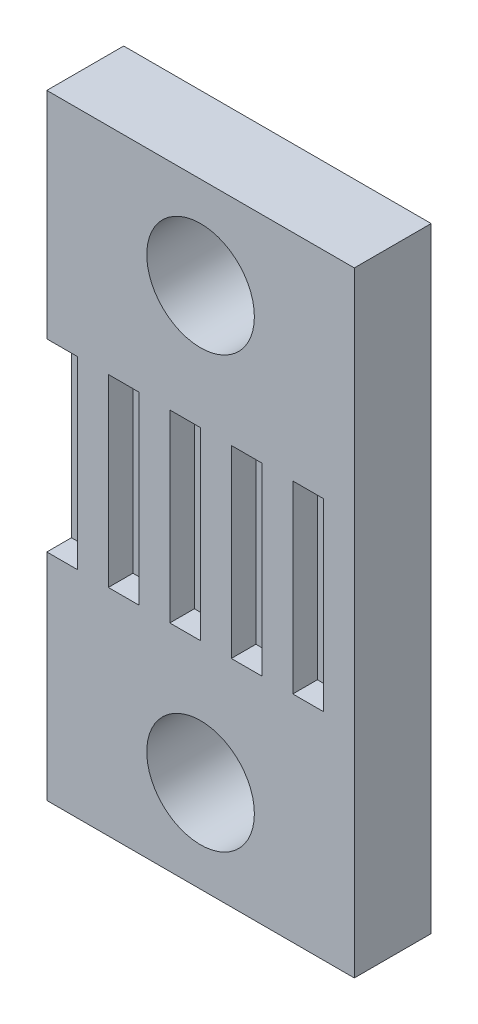
ISO-10303-21;
HEADER;
FILE_DESCRIPTION(('STEP AP214'),'2;1');
FILE_NAME('part.step','',(''),(''),'','','');
FILE_SCHEMA(('AUTOMOTIVE_DESIGN { 1 0 10303 214 1 1 1 1 }'));
ENDSEC;
DATA;
#1=APPLICATION_CONTEXT('core data for automotive mechanical design processes');
#2=APPLICATION_PROTOCOL_DEFINITION('international standard','automotive_design',2000,#1);
#3=PRODUCT_CONTEXT('',#1,'mechanical');
#4=PRODUCT('Part','Part','',(#3));
#5=PRODUCT_RELATED_PRODUCT_CATEGORY('part','',(#4));
#6=PRODUCT_DEFINITION_FORMATION('','',#4);
#7=PRODUCT_DEFINITION_CONTEXT('part definition',#1,'design');
#8=PRODUCT_DEFINITION('design','',#6,#7);
#9=PRODUCT_DEFINITION_SHAPE('','',#8);
#10=(LENGTH_UNIT() NAMED_UNIT(*) SI_UNIT(.MILLI.,.METRE.));
#11=(NAMED_UNIT(*) PLANE_ANGLE_UNIT() SI_UNIT($,.RADIAN.));
#12=(NAMED_UNIT(*) SI_UNIT($,.STERADIAN.) SOLID_ANGLE_UNIT());
#13=UNCERTAINTY_MEASURE_WITH_UNIT(LENGTH_MEASURE(1.E-05),#10,'distance_accuracy_value','');
#14=(GEOMETRIC_REPRESENTATION_CONTEXT(3) GLOBAL_UNCERTAINTY_ASSIGNED_CONTEXT((#13)) GLOBAL_UNIT_ASSIGNED_CONTEXT((#10,
#11,#12)) REPRESENTATION_CONTEXT('',''));
#15=CARTESIAN_POINT('',(0.,0.,0.));
#16=DIRECTION('',(0.,0.,1.));
#17=DIRECTION('',(1.,0.,0.));
#18=AXIS2_PLACEMENT_3D('',#15,#16,#17);
#19=CARTESIAN_POINT('',(0.,0.,2.5));
#20=DIRECTION('',(0.,0.,-1.));
#21=DIRECTION('',(-1.,0.,0.));
#22=AXIS2_PLACEMENT_3D('',#19,#20,#21);
#23=PLANE('',#22);
#24=DIRECTION('',(1.,0.,0.));
#25=VECTOR('',#24,1.);
#26=CARTESIAN_POINT('',(2.,7.,2.5));
#27=LINE('',#26,#25);
#28=CARTESIAN_POINT('',(2.,7.,2.5));
#29=VERTEX_POINT('',#28);
#30=CARTESIAN_POINT('',(3.,7.,2.5));
#31=VERTEX_POINT('',#30);
#32=EDGE_CURVE('E227',#29,#31,#27,.T.);
#33=ORIENTED_EDGE('',*,*,#32,.F.);
#34=DIRECTION('',(0.,-1.,0.));
#35=VECTOR('',#34,1.);
#36=CARTESIAN_POINT('',(2.,13.,2.5));
#37=LINE('',#36,#35);
#38=CARTESIAN_POINT('',(2.,13.,2.5));
#39=VERTEX_POINT('',#38);
#40=EDGE_CURVE('E52',#39,#29,#37,.T.);
#41=ORIENTED_EDGE('',*,*,#40,.F.);
#42=DIRECTION('',(-1.,0.,0.));
#43=VECTOR('',#42,1.);
#44=CARTESIAN_POINT('',(2.,13.,2.5));
#45=LINE('',#44,#43);
#46=CARTESIAN_POINT('',(3.,13.,2.5));
#47=VERTEX_POINT('',#46);
#48=EDGE_CURVE('E218',#47,#39,#45,.T.);
#49=ORIENTED_EDGE('',*,*,#48,.F.);
#50=DIRECTION('',(0.,1.,0.));
#51=VECTOR('',#50,1.);
#52=CARTESIAN_POINT('',(3.,13.,2.5));
#53=LINE('',#52,#51);
#54=EDGE_CURVE('E221',#31,#47,#53,.T.);
#55=ORIENTED_EDGE('',*,*,#54,.F.);
#56=EDGE_LOOP('',(#33,#41,#49,#55));
#57=FACE_BOUND('',#56,.T.);
#58=DIRECTION('',(1.,0.,0.));
#59=VECTOR('',#58,1.);
#60=CARTESIAN_POINT('',(4.,7.,2.5));
#61=LINE('',#60,#59);
#62=CARTESIAN_POINT('',(4.,7.,2.5));
#63=VERTEX_POINT('',#62);
#64=CARTESIAN_POINT('',(5.,7.,2.5));
#65=VERTEX_POINT('',#64);
#66=EDGE_CURVE('E253',#63,#65,#61,.T.);
#67=ORIENTED_EDGE('',*,*,#66,.F.);
#68=DIRECTION('',(0.,-1.,0.));
#69=VECTOR('',#68,1.);
#70=CARTESIAN_POINT('',(4.,13.,2.5));
#71=LINE('',#70,#69);
#72=CARTESIAN_POINT('',(4.,13.,2.5));
#73=VERTEX_POINT('',#72);
#74=EDGE_CURVE('E60',#73,#63,#71,.T.);
#75=ORIENTED_EDGE('',*,*,#74,.F.);
#76=DIRECTION('',(-1.,0.,0.));
#77=VECTOR('',#76,1.);
#78=CARTESIAN_POINT('',(4.,13.,2.5));
#79=LINE('',#78,#77);
#80=CARTESIAN_POINT('',(5.,13.,2.5));
#81=VERTEX_POINT('',#80);
#82=EDGE_CURVE('E242',#81,#73,#79,.T.);
#83=ORIENTED_EDGE('',*,*,#82,.F.);
#84=DIRECTION('',(0.,1.,0.));
#85=VECTOR('',#84,1.);
#86=CARTESIAN_POINT('',(5.,13.,2.5));
#87=LINE('',#86,#85);
#88=EDGE_CURVE('E257',#65,#81,#87,.T.);
#89=ORIENTED_EDGE('',*,*,#88,.F.);
#90=EDGE_LOOP('',(#67,#75,#83,#89));
#91=FACE_BOUND('',#90,.T.);
#92=DIRECTION('',(1.,0.,0.));
#93=VECTOR('',#92,1.);
#94=CARTESIAN_POINT('',(6.,7.,2.5));
#95=LINE('',#94,#93);
#96=CARTESIAN_POINT('',(6.,7.,2.5));
#97=VERTEX_POINT('',#96);
#98=CARTESIAN_POINT('',(7.,7.,2.5));
#99=VERTEX_POINT('',#98);
#100=EDGE_CURVE('E284',#97,#99,#95,.T.);
#101=ORIENTED_EDGE('',*,*,#100,.F.);
#102=DIRECTION('',(0.,-1.,0.));
#103=VECTOR('',#102,1.);
#104=CARTESIAN_POINT('',(6.,13.,2.5));
#105=LINE('',#104,#103);
#106=CARTESIAN_POINT('',(6.,13.,2.5));
#107=VERTEX_POINT('',#106);
#108=EDGE_CURVE('E282',#107,#97,#105,.T.);
#109=ORIENTED_EDGE('',*,*,#108,.F.);
#110=DIRECTION('',(-1.,0.,0.));
#111=VECTOR('',#110,1.);
#112=CARTESIAN_POINT('',(6.,13.,2.5));
#113=LINE('',#112,#111);
#114=CARTESIAN_POINT('',(7.,13.,2.5));
#115=VERTEX_POINT('',#114);
#116=EDGE_CURVE('E272',#115,#107,#113,.T.);
#117=ORIENTED_EDGE('',*,*,#116,.F.);
#118=DIRECTION('',(0.,1.,0.));
#119=VECTOR('',#118,1.);
#120=CARTESIAN_POINT('',(7.,13.,2.5));
#121=LINE('',#120,#119);
#122=EDGE_CURVE('E288',#99,#115,#121,.T.);
#123=ORIENTED_EDGE('',*,*,#122,.F.);
#124=EDGE_LOOP('',(#101,#109,#117,#123));
#125=FACE_BOUND('',#124,.T.);
#126=DIRECTION('',(1.,0.,0.));
#127=VECTOR('',#126,1.);
#128=CARTESIAN_POINT('',(8.,7.,2.5));
#129=LINE('',#128,#127);
#130=CARTESIAN_POINT('',(8.,7.,2.5));
#131=VERTEX_POINT('',#130);
#132=CARTESIAN_POINT('',(9.,7.,2.5));
#133=VERTEX_POINT('',#132);
#134=EDGE_CURVE('E316',#131,#133,#129,.T.);
#135=ORIENTED_EDGE('',*,*,#134,.F.);
#136=DIRECTION('',(0.,-1.,0.));
#137=VECTOR('',#136,1.);
#138=CARTESIAN_POINT('',(8.,13.,2.5));
#139=LINE('',#138,#137);
#140=CARTESIAN_POINT('',(8.,13.,2.5));
#141=VERTEX_POINT('',#140);
#142=EDGE_CURVE('E314',#141,#131,#139,.T.);
#143=ORIENTED_EDGE('',*,*,#142,.F.);
#144=DIRECTION('',(-1.,0.,0.));
#145=VECTOR('',#144,1.);
#146=CARTESIAN_POINT('',(8.,13.,2.5));
#147=LINE('',#146,#145);
#148=CARTESIAN_POINT('',(9.,13.,2.5));
#149=VERTEX_POINT('',#148);
#150=EDGE_CURVE('E304',#149,#141,#147,.T.);
#151=ORIENTED_EDGE('',*,*,#150,.F.);
#152=DIRECTION('',(0.,1.,0.));
#153=VECTOR('',#152,1.);
#154=CARTESIAN_POINT('',(9.,13.,2.5));
#155=LINE('',#154,#153);
#156=EDGE_CURVE('E319',#133,#149,#155,.T.);
#157=ORIENTED_EDGE('',*,*,#156,.F.);
#158=EDGE_LOOP('',(#135,#143,#151,#157));
#159=FACE_BOUND('',#158,.T.);
#160=DIRECTION('',(0.,-1.,0.));
#161=VECTOR('',#160,1.);
#162=CARTESIAN_POINT('',(0.,0.,2.5));
#163=LINE('',#162,#161);
#164=CARTESIAN_POINT('',(0.,20.,2.5));
#165=VERTEX_POINT('',#164);
#166=CARTESIAN_POINT('',(0.,13.,2.5));
#167=VERTEX_POINT('',#166);
#168=EDGE_CURVE('E371',#165,#167,#163,.T.);
#169=ORIENTED_EDGE('',*,*,#168,.T.);
#170=DIRECTION('',(-1.,0.,0.));
#171=VECTOR('',#170,1.);
#172=CARTESIAN_POINT('',(0.,13.,2.5));
#173=LINE('',#172,#171);
#174=CARTESIAN_POINT('',(0.999999999999995,13.,2.5));
#175=VERTEX_POINT('',#174);
#176=EDGE_CURVE('E335',#175,#167,#173,.T.);
#177=ORIENTED_EDGE('',*,*,#176,.F.);
#178=DIRECTION('',(0.,1.,0.));
#179=VECTOR('',#178,1.);
#180=CARTESIAN_POINT('',(0.999999999999995,13.,2.5));
#181=LINE('',#180,#179);
#182=CARTESIAN_POINT('',(0.999999999999995,7.,2.5));
#183=VERTEX_POINT('',#182);
#184=EDGE_CURVE('E346',#183,#175,#181,.T.);
#185=ORIENTED_EDGE('',*,*,#184,.F.);
#186=DIRECTION('',(1.,0.,0.));
#187=VECTOR('',#186,1.);
#188=CARTESIAN_POINT('',(0.,7.,2.5));
#189=LINE('',#188,#187);
#190=CARTESIAN_POINT('',(0.,7.,2.5));
#191=VERTEX_POINT('',#190);
#192=EDGE_CURVE('E234',#191,#183,#189,.T.);
#193=ORIENTED_EDGE('',*,*,#192,.F.);
#194=CARTESIAN_POINT('',(0.,0.,2.5));
#195=VERTEX_POINT('',#194);
#196=EDGE_CURVE('E375',#191,#195,#163,.T.);
#197=ORIENTED_EDGE('',*,*,#196,.T.);
#198=DIRECTION('',(1.,0.,0.));
#199=VECTOR('',#198,1.);
#200=CARTESIAN_POINT('',(0.,0.,2.5));
#201=LINE('',#200,#199);
#202=CARTESIAN_POINT('',(10.,0.,2.5));
#203=VERTEX_POINT('',#202);
#204=EDGE_CURVE('E374',#195,#203,#201,.T.);
#205=ORIENTED_EDGE('',*,*,#204,.T.);
#206=DIRECTION('',(0.,1.,0.));
#207=VECTOR('',#206,1.);
#208=CARTESIAN_POINT('',(10.,0.,2.5));
#209=LINE('',#208,#207);
#210=CARTESIAN_POINT('',(10.,20.,2.5));
#211=VERTEX_POINT('',#210);
#212=EDGE_CURVE('E377',#203,#211,#209,.T.);
#213=ORIENTED_EDGE('',*,*,#212,.T.);
#214=DIRECTION('',(-1.,0.,0.));
#215=VECTOR('',#214,1.);
#216=CARTESIAN_POINT('',(0.,20.,2.5));
#217=LINE('',#216,#215);
#218=EDGE_CURVE('E379',#211,#165,#217,.T.);
#219=ORIENTED_EDGE('',*,*,#218,.T.);
#220=EDGE_LOOP('',(#169,#177,#185,#193,#197,#205,#213,#219));
#221=FACE_BOUND('',#220,.T.);
#222=CARTESIAN_POINT('',(5.,17.,2.5));
#223=DIRECTION('',(0.,0.,1.));
#224=DIRECTION('',(1.,0.,0.));
#225=AXIS2_PLACEMENT_3D('',#222,#223,#224);
#226=CIRCLE('',#225,1.75);
#227=CARTESIAN_POINT('',(6.75,17.,2.5));
#228=VERTEX_POINT('',#227);
#229=EDGE_CURVE('E365',#228,#228,#226,.T.);
#230=ORIENTED_EDGE('',*,*,#229,.F.);
#231=EDGE_LOOP('',(#230));
#232=FACE_BOUND('',#231,.T.);
#233=CARTESIAN_POINT('',(5.,3.,2.5));
#234=DIRECTION('',(0.,0.,1.));
#235=DIRECTION('',(1.,0.,0.));
#236=AXIS2_PLACEMENT_3D('',#233,#234,#235);
#237=CIRCLE('',#236,1.75);
#238=CARTESIAN_POINT('',(6.75,3.,2.5));
#239=VERTEX_POINT('',#238);
#240=EDGE_CURVE('E359',#239,#239,#237,.T.);
#241=ORIENTED_EDGE('',*,*,#240,.F.);
#242=EDGE_LOOP('',(#241));
#243=FACE_BOUND('',#242,.T.);
#244=ADVANCED_FACE('F37',(#57,#91,#125,#159,#221,#232,#243),#23,.F.);
#245=CARTESIAN_POINT('',(0.,0.,0.));
#246=DIRECTION('',(0.,0.,-1.));
#247=DIRECTION('',(-1.,0.,0.));
#248=AXIS2_PLACEMENT_3D('',#245,#246,#247);
#249=PLANE('',#248);
#250=CARTESIAN_POINT('',(5.,17.,0.));
#251=DIRECTION('',(0.,0.,1.));
#252=DIRECTION('',(1.,0.,0.));
#253=AXIS2_PLACEMENT_3D('',#250,#251,#252);
#254=CIRCLE('',#253,1.75);
#255=CARTESIAN_POINT('',(6.75,17.,0.));
#256=VERTEX_POINT('',#255);
#257=EDGE_CURVE('E362',#256,#256,#254,.T.);
#258=ORIENTED_EDGE('',*,*,#257,.T.);
#259=EDGE_LOOP('',(#258));
#260=FACE_BOUND('',#259,.T.);
#261=DIRECTION('',(0.,-1.,0.));
#262=VECTOR('',#261,1.);
#263=CARTESIAN_POINT('',(0.,0.,0.));
#264=LINE('',#263,#262);
#265=CARTESIAN_POINT('',(0.,20.,0.));
#266=VERTEX_POINT('',#265);
#267=CARTESIAN_POINT('',(0.,0.,0.));
#268=VERTEX_POINT('',#267);
#269=EDGE_CURVE('E368',#266,#268,#264,.T.);
#270=ORIENTED_EDGE('',*,*,#269,.F.);
#271=DIRECTION('',(-1.,0.,0.));
#272=VECTOR('',#271,1.);
#273=CARTESIAN_POINT('',(0.,20.,0.));
#274=LINE('',#273,#272);
#275=CARTESIAN_POINT('',(10.,20.,0.));
#276=VERTEX_POINT('',#275);
#277=EDGE_CURVE('E388',#276,#266,#274,.T.);
#278=ORIENTED_EDGE('',*,*,#277,.F.);
#279=DIRECTION('',(0.,1.,0.));
#280=VECTOR('',#279,1.);
#281=CARTESIAN_POINT('',(10.,0.,0.));
#282=LINE('',#281,#280);
#283=CARTESIAN_POINT('',(10.,0.,0.));
#284=VERTEX_POINT('',#283);
#285=EDGE_CURVE('E386',#284,#276,#282,.T.);
#286=ORIENTED_EDGE('',*,*,#285,.F.);
#287=DIRECTION('',(1.,0.,0.));
#288=VECTOR('',#287,1.);
#289=CARTESIAN_POINT('',(0.,0.,0.));
#290=LINE('',#289,#288);
#291=EDGE_CURVE('E384',#268,#284,#290,.T.);
#292=ORIENTED_EDGE('',*,*,#291,.F.);
#293=EDGE_LOOP('',(#270,#278,#286,#292));
#294=FACE_BOUND('',#293,.T.);
#295=CARTESIAN_POINT('',(5.,3.,0.));
#296=DIRECTION('',(0.,0.,1.));
#297=DIRECTION('',(1.,0.,0.));
#298=AXIS2_PLACEMENT_3D('',#295,#296,#297);
#299=CIRCLE('',#298,1.75);
#300=CARTESIAN_POINT('',(6.75,3.,0.));
#301=VERTEX_POINT('',#300);
#302=EDGE_CURVE('E353',#301,#301,#299,.T.);
#303=ORIENTED_EDGE('',*,*,#302,.T.);
#304=EDGE_LOOP('',(#303));
#305=FACE_BOUND('',#304,.T.);
#306=ADVANCED_FACE('F406',(#260,#294,#305),#249,.T.);
#307=CARTESIAN_POINT('',(0.,0.,2.5));
#308=DIRECTION('',(1.,0.,0.));
#309=DIRECTION('',(0.,1.,0.));
#310=AXIS2_PLACEMENT_3D('',#307,#308,#309);
#311=PLANE('',#310);
#312=DIRECTION('',(0.,-1.,0.));
#313=VECTOR('',#312,1.);
#314=CARTESIAN_POINT('',(0.,13.,1.7));
#315=LINE('',#314,#313);
#316=CARTESIAN_POINT('',(0.,13.,1.7));
#317=VERTEX_POINT('',#316);
#318=CARTESIAN_POINT('',(0.,7.,1.7));
#319=VERTEX_POINT('',#318);
#320=EDGE_CURVE('E331',#317,#319,#315,.T.);
#321=ORIENTED_EDGE('',*,*,#320,.F.);
#322=DIRECTION('',(0.,0.,1.));
#323=VECTOR('',#322,1.);
#324=CARTESIAN_POINT('',(0.,13.,1.7));
#325=LINE('',#324,#323);
#326=EDGE_CURVE('E350',#317,#167,#325,.T.);
#327=ORIENTED_EDGE('',*,*,#326,.T.);
#328=ORIENTED_EDGE('',*,*,#168,.F.);
#329=DIRECTION('',(0.,0.,-1.));
#330=VECTOR('',#329,1.);
#331=CARTESIAN_POINT('',(0.,20.,2.5));
#332=LINE('',#331,#330);
#333=EDGE_CURVE('E381',#165,#266,#332,.T.);
#334=ORIENTED_EDGE('',*,*,#333,.T.);
#335=ORIENTED_EDGE('',*,*,#269,.T.);
#336=DIRECTION('',(0.,0.,-1.));
#337=VECTOR('',#336,1.);
#338=CARTESIAN_POINT('',(0.,0.,2.5));
#339=LINE('',#338,#337);
#340=EDGE_CURVE('E11',#195,#268,#339,.T.);
#341=ORIENTED_EDGE('',*,*,#340,.F.);
#342=ORIENTED_EDGE('',*,*,#196,.F.);
#343=DIRECTION('',(0.,0.,1.));
#344=VECTOR('',#343,1.);
#345=CARTESIAN_POINT('',(0.,7.,1.7));
#346=LINE('',#345,#344);
#347=EDGE_CURVE('E343',#319,#191,#346,.T.);
#348=ORIENTED_EDGE('',*,*,#347,.F.);
#349=EDGE_LOOP('',(#321,#327,#328,#334,#335,#341,#342,#348));
#350=FACE_BOUND('',#349,.T.);
#351=ADVANCED_FACE('F39',(#350),#311,.F.);
#352=CARTESIAN_POINT('',(0.,0.,2.5));
#353=DIRECTION('',(0.,1.,0.));
#354=DIRECTION('',(0.,0.,1.));
#355=AXIS2_PLACEMENT_3D('',#352,#353,#354);
#356=PLANE('',#355);
#357=ORIENTED_EDGE('',*,*,#291,.T.);
#358=DIRECTION('',(0.,0.,-1.));
#359=VECTOR('',#358,1.);
#360=CARTESIAN_POINT('',(10.,0.,2.5));
#361=LINE('',#360,#359);
#362=EDGE_CURVE('E45',#203,#284,#361,.T.);
#363=ORIENTED_EDGE('',*,*,#362,.F.);
#364=ORIENTED_EDGE('',*,*,#204,.F.);
#365=ORIENTED_EDGE('',*,*,#340,.T.);
#366=EDGE_LOOP('',(#357,#363,#364,#365));
#367=FACE_BOUND('',#366,.T.);
#368=ADVANCED_FACE('F423',(#367),#356,.F.);
#369=CARTESIAN_POINT('',(10.,0.,2.5));
#370=DIRECTION('',(-1.,0.,0.));
#371=DIRECTION('',(0.,0.,1.));
#372=AXIS2_PLACEMENT_3D('',#369,#370,#371);
#373=PLANE('',#372);
#374=ORIENTED_EDGE('',*,*,#285,.T.);
#375=DIRECTION('',(0.,0.,-1.));
#376=VECTOR('',#375,1.);
#377=CARTESIAN_POINT('',(10.,20.,2.5));
#378=LINE('',#377,#376);
#379=EDGE_CURVE('E392',#211,#276,#378,.T.);
#380=ORIENTED_EDGE('',*,*,#379,.F.);
#381=ORIENTED_EDGE('',*,*,#212,.F.);
#382=ORIENTED_EDGE('',*,*,#362,.T.);
#383=EDGE_LOOP('',(#374,#380,#381,#382));
#384=FACE_BOUND('',#383,.T.);
#385=ADVANCED_FACE('F399',(#384),#373,.F.);
#386=CARTESIAN_POINT('',(0.,20.,2.5));
#387=DIRECTION('',(0.,-1.,0.));
#388=DIRECTION('',(0.,0.,-1.));
#389=AXIS2_PLACEMENT_3D('',#386,#387,#388);
#390=PLANE('',#389);
#391=ORIENTED_EDGE('',*,*,#277,.T.);
#392=ORIENTED_EDGE('',*,*,#333,.F.);
#393=ORIENTED_EDGE('',*,*,#218,.F.);
#394=ORIENTED_EDGE('',*,*,#379,.T.);
#395=EDGE_LOOP('',(#391,#392,#393,#394));
#396=FACE_BOUND('',#395,.T.);
#397=ADVANCED_FACE('F410',(#396),#390,.F.);
#398=CARTESIAN_POINT('',(5.,17.,2.5));
#399=DIRECTION('',(0.,0.,-1.));
#400=DIRECTION('',(-1.,0.,0.));
#401=AXIS2_PLACEMENT_3D('',#398,#399,#400);
#402=CYLINDRICAL_SURFACE('',#401,1.75);
#403=ORIENTED_EDGE('',*,*,#229,.T.);
#404=EDGE_LOOP('',(#403));
#405=FACE_BOUND('',#404,.T.);
#406=ORIENTED_EDGE('',*,*,#257,.F.);
#407=EDGE_LOOP('',(#406));
#408=FACE_BOUND('',#407,.T.);
#409=ADVANCED_FACE('F443',(#405,#408),#402,.F.);
#410=CARTESIAN_POINT('',(5.,3.,2.5));
#411=DIRECTION('',(0.,0.,-1.));
#412=DIRECTION('',(-1.,0.,0.));
#413=AXIS2_PLACEMENT_3D('',#410,#411,#412);
#414=CYLINDRICAL_SURFACE('',#413,1.75);
#415=ORIENTED_EDGE('',*,*,#240,.T.);
#416=EDGE_LOOP('',(#415));
#417=FACE_BOUND('',#416,.T.);
#418=ORIENTED_EDGE('',*,*,#302,.F.);
#419=EDGE_LOOP('',(#418));
#420=FACE_BOUND('',#419,.T.);
#421=ADVANCED_FACE('F436',(#417,#420),#414,.F.);
#422=CARTESIAN_POINT('',(0.,13.,1.7));
#423=DIRECTION('',(0.,1.,0.));
#424=DIRECTION('',(0.,0.,1.));
#425=AXIS2_PLACEMENT_3D('',#422,#423,#424);
#426=PLANE('',#425);
#427=ORIENTED_EDGE('',*,*,#176,.T.);
#428=ORIENTED_EDGE('',*,*,#326,.F.);
#429=DIRECTION('',(-1.,0.,0.));
#430=VECTOR('',#429,1.);
#431=CARTESIAN_POINT('',(0.,13.,1.7));
#432=LINE('',#431,#430);
#433=CARTESIAN_POINT('',(0.999999999999995,13.,1.7));
#434=VERTEX_POINT('',#433);
#435=EDGE_CURVE('E341',#434,#317,#432,.T.);
#436=ORIENTED_EDGE('',*,*,#435,.F.);
#437=DIRECTION('',(0.,0.,1.));
#438=VECTOR('',#437,1.);
#439=CARTESIAN_POINT('',(0.999999999999995,13.,1.7));
#440=LINE('',#439,#438);
#441=EDGE_CURVE('E354',#434,#175,#440,.T.);
#442=ORIENTED_EDGE('',*,*,#441,.T.);
#443=EDGE_LOOP('',(#427,#428,#436,#442));
#444=FACE_BOUND('',#443,.T.);
#445=ADVANCED_FACE('F434',(#444),#426,.F.);
#446=CARTESIAN_POINT('',(0.999999999999995,13.,1.7));
#447=DIRECTION('',(1.,0.,0.));
#448=DIRECTION('',(0.,0.,-1.));
#449=AXIS2_PLACEMENT_3D('',#446,#447,#448);
#450=PLANE('',#449);
#451=ORIENTED_EDGE('',*,*,#184,.T.);
#452=ORIENTED_EDGE('',*,*,#441,.F.);
#453=DIRECTION('',(0.,1.,0.));
#454=VECTOR('',#453,1.);
#455=CARTESIAN_POINT('',(0.999999999999995,13.,1.7));
#456=LINE('',#455,#454);
#457=CARTESIAN_POINT('',(0.999999999999995,7.,1.7));
#458=VERTEX_POINT('',#457);
#459=EDGE_CURVE('E338',#458,#434,#456,.T.);
#460=ORIENTED_EDGE('',*,*,#459,.F.);
#461=DIRECTION('',(0.,0.,1.));
#462=VECTOR('',#461,1.);
#463=CARTESIAN_POINT('',(0.999999999999995,7.,1.7));
#464=LINE('',#463,#462);
#465=EDGE_CURVE('E356',#458,#183,#464,.T.);
#466=ORIENTED_EDGE('',*,*,#465,.T.);
#467=EDGE_LOOP('',(#451,#452,#460,#466));
#468=FACE_BOUND('',#467,.T.);
#469=ADVANCED_FACE('F428',(#468),#450,.F.);
#470=CARTESIAN_POINT('',(0.,7.,1.7));
#471=DIRECTION('',(0.,-1.,0.));
#472=DIRECTION('',(0.,0.,-1.));
#473=AXIS2_PLACEMENT_3D('',#470,#471,#472);
#474=PLANE('',#473);
#475=ORIENTED_EDGE('',*,*,#192,.T.);
#476=ORIENTED_EDGE('',*,*,#465,.F.);
#477=DIRECTION('',(1.,0.,0.));
#478=VECTOR('',#477,1.);
#479=CARTESIAN_POINT('',(0.,7.,1.7));
#480=LINE('',#479,#478);
#481=EDGE_CURVE('E334',#319,#458,#480,.T.);
#482=ORIENTED_EDGE('',*,*,#481,.F.);
#483=ORIENTED_EDGE('',*,*,#347,.T.);
#484=EDGE_LOOP('',(#475,#476,#482,#483));
#485=FACE_BOUND('',#484,.T.);
#486=ADVANCED_FACE('F426',(#485),#474,.F.);
#487=CARTESIAN_POINT('',(0.,0.,1.7));
#488=DIRECTION('',(0.,0.,1.));
#489=DIRECTION('',(1.,0.,0.));
#490=AXIS2_PLACEMENT_3D('',#487,#488,#489);
#491=PLANE('',#490);
#492=ORIENTED_EDGE('',*,*,#320,.T.);
#493=ORIENTED_EDGE('',*,*,#481,.T.);
#494=ORIENTED_EDGE('',*,*,#459,.T.);
#495=ORIENTED_EDGE('',*,*,#435,.T.);
#496=EDGE_LOOP('',(#492,#493,#494,#495));
#497=FACE_BOUND('',#496,.T.);
#498=ADVANCED_FACE('F432',(#497),#491,.T.);
#499=CARTESIAN_POINT('',(8.,13.,1.7));
#500=DIRECTION('',(-1.,0.,0.));
#501=DIRECTION('',(0.,0.,1.));
#502=AXIS2_PLACEMENT_3D('',#499,#500,#501);
#503=PLANE('',#502);
#504=ORIENTED_EDGE('',*,*,#142,.T.);
#505=DIRECTION('',(0.,0.,1.));
#506=VECTOR('',#505,1.);
#507=CARTESIAN_POINT('',(8.,7.,1.7));
#508=LINE('',#507,#506);
#509=CARTESIAN_POINT('',(8.,7.,1.7));
#510=VERTEX_POINT('',#509);
#511=EDGE_CURVE('E313',#510,#131,#508,.T.);
#512=ORIENTED_EDGE('',*,*,#511,.F.);
#513=DIRECTION('',(0.,-1.,0.));
#514=VECTOR('',#513,1.);
#515=CARTESIAN_POINT('',(8.,13.,1.7));
#516=LINE('',#515,#514);
#517=CARTESIAN_POINT('',(8.,13.,1.7));
#518=VERTEX_POINT('',#517);
#519=EDGE_CURVE('E300',#518,#510,#516,.T.);
#520=ORIENTED_EDGE('',*,*,#519,.F.);
#521=DIRECTION('',(0.,0.,1.));
#522=VECTOR('',#521,1.);
#523=CARTESIAN_POINT('',(8.,13.,1.7));
#524=LINE('',#523,#522);
#525=EDGE_CURVE('E285',#518,#141,#524,.T.);
#526=ORIENTED_EDGE('',*,*,#525,.T.);
#527=EDGE_LOOP('',(#504,#512,#520,#526));
#528=FACE_BOUND('',#527,.T.);
#529=ADVANCED_FACE('F531',(#528),#503,.F.);
#530=CARTESIAN_POINT('',(8.,13.,1.7));
#531=DIRECTION('',(0.,1.,0.));
#532=DIRECTION('',(0.,0.,1.));
#533=AXIS2_PLACEMENT_3D('',#530,#531,#532);
#534=PLANE('',#533);
#535=ORIENTED_EDGE('',*,*,#150,.T.);
#536=ORIENTED_EDGE('',*,*,#525,.F.);
#537=DIRECTION('',(-1.,0.,0.));
#538=VECTOR('',#537,1.);
#539=CARTESIAN_POINT('',(8.,13.,1.7));
#540=LINE('',#539,#538);
#541=CARTESIAN_POINT('',(9.,13.,1.7));
#542=VERTEX_POINT('',#541);
#543=EDGE_CURVE('E310',#542,#518,#540,.T.);
#544=ORIENTED_EDGE('',*,*,#543,.F.);
#545=DIRECTION('',(0.,0.,1.));
#546=VECTOR('',#545,1.);
#547=CARTESIAN_POINT('',(9.,13.,1.7));
#548=LINE('',#547,#546);
#549=EDGE_CURVE('E325',#542,#149,#548,.T.);
#550=ORIENTED_EDGE('',*,*,#549,.T.);
#551=EDGE_LOOP('',(#535,#536,#544,#550));
#552=FACE_BOUND('',#551,.T.);
#553=ADVANCED_FACE('F538',(#552),#534,.F.);
#554=CARTESIAN_POINT('',(9.,13.,1.7));
#555=DIRECTION('',(1.,0.,0.));
#556=DIRECTION('',(0.,0.,-1.));
#557=AXIS2_PLACEMENT_3D('',#554,#555,#556);
#558=PLANE('',#557);
#559=ORIENTED_EDGE('',*,*,#156,.T.);
#560=ORIENTED_EDGE('',*,*,#549,.F.);
#561=DIRECTION('',(0.,1.,0.));
#562=VECTOR('',#561,1.);
#563=CARTESIAN_POINT('',(9.,13.,1.7));
#564=LINE('',#563,#562);
#565=CARTESIAN_POINT('',(9.,7.,1.7));
#566=VERTEX_POINT('',#565);
#567=EDGE_CURVE('E307',#566,#542,#564,.T.);
#568=ORIENTED_EDGE('',*,*,#567,.F.);
#569=DIRECTION('',(0.,0.,1.));
#570=VECTOR('',#569,1.);
#571=CARTESIAN_POINT('',(9.,7.,1.7));
#572=LINE('',#571,#570);
#573=EDGE_CURVE('E327',#566,#133,#572,.T.);
#574=ORIENTED_EDGE('',*,*,#573,.T.);
#575=EDGE_LOOP('',(#559,#560,#568,#574));
#576=FACE_BOUND('',#575,.T.);
#577=ADVANCED_FACE('F547',(#576),#558,.F.);
#578=CARTESIAN_POINT('',(8.,7.,1.7));
#579=DIRECTION('',(0.,-1.,0.));
#580=DIRECTION('',(0.,0.,-1.));
#581=AXIS2_PLACEMENT_3D('',#578,#579,#580);
#582=PLANE('',#581);
#583=ORIENTED_EDGE('',*,*,#134,.T.);
#584=ORIENTED_EDGE('',*,*,#573,.F.);
#585=DIRECTION('',(1.,0.,0.));
#586=VECTOR('',#585,1.);
#587=CARTESIAN_POINT('',(8.,7.,1.7));
#588=LINE('',#587,#586);
#589=EDGE_CURVE('E303',#510,#566,#588,.T.);
#590=ORIENTED_EDGE('',*,*,#589,.F.);
#591=ORIENTED_EDGE('',*,*,#511,.T.);
#592=EDGE_LOOP('',(#583,#584,#590,#591));
#593=FACE_BOUND('',#592,.T.);
#594=ADVANCED_FACE('F556',(#593),#582,.F.);
#595=CARTESIAN_POINT('',(0.,0.,1.7));
#596=DIRECTION('',(0.,0.,1.));
#597=DIRECTION('',(1.,0.,0.));
#598=AXIS2_PLACEMENT_3D('',#595,#596,#597);
#599=PLANE('',#598);
#600=ORIENTED_EDGE('',*,*,#519,.T.);
#601=ORIENTED_EDGE('',*,*,#589,.T.);
#602=ORIENTED_EDGE('',*,*,#567,.T.);
#603=ORIENTED_EDGE('',*,*,#543,.T.);
#604=EDGE_LOOP('',(#600,#601,#602,#603));
#605=FACE_BOUND('',#604,.T.);
#606=ADVANCED_FACE('F565',(#605),#599,.T.);
#607=CARTESIAN_POINT('',(6.,13.,1.7));
#608=DIRECTION('',(-1.,0.,0.));
#609=DIRECTION('',(0.,0.,1.));
#610=AXIS2_PLACEMENT_3D('',#607,#608,#609);
#611=PLANE('',#610);
#612=ORIENTED_EDGE('',*,*,#108,.T.);
#613=DIRECTION('',(0.,0.,1.));
#614=VECTOR('',#613,1.);
#615=CARTESIAN_POINT('',(6.,7.,1.7));
#616=LINE('',#615,#614);
#617=CARTESIAN_POINT('',(6.,7.,1.7));
#618=VERTEX_POINT('',#617);
#619=EDGE_CURVE('E281',#618,#97,#616,.T.);
#620=ORIENTED_EDGE('',*,*,#619,.F.);
#621=DIRECTION('',(0.,-1.,0.));
#622=VECTOR('',#621,1.);
#623=CARTESIAN_POINT('',(6.,13.,1.7));
#624=LINE('',#623,#622);
#625=CARTESIAN_POINT('',(6.,13.,1.7));
#626=VERTEX_POINT('',#625);
#627=EDGE_CURVE('E268',#626,#618,#624,.T.);
#628=ORIENTED_EDGE('',*,*,#627,.F.);
#629=DIRECTION('',(0.,0.,1.));
#630=VECTOR('',#629,1.);
#631=CARTESIAN_POINT('',(6.,13.,1.7));
#632=LINE('',#631,#630);
#633=EDGE_CURVE('E254',#626,#107,#632,.T.);
#634=ORIENTED_EDGE('',*,*,#633,.T.);
#635=EDGE_LOOP('',(#612,#620,#628,#634));
#636=FACE_BOUND('',#635,.T.);
#637=ADVANCED_FACE('F574',(#636),#611,.F.);
#638=CARTESIAN_POINT('',(6.,13.,1.7));
#639=DIRECTION('',(0.,1.,0.));
#640=DIRECTION('',(0.,0.,1.));
#641=AXIS2_PLACEMENT_3D('',#638,#639,#640);
#642=PLANE('',#641);
#643=ORIENTED_EDGE('',*,*,#116,.T.);
#644=ORIENTED_EDGE('',*,*,#633,.F.);
#645=DIRECTION('',(-1.,0.,0.));
#646=VECTOR('',#645,1.);
#647=CARTESIAN_POINT('',(6.,13.,1.7));
#648=LINE('',#647,#646);
#649=CARTESIAN_POINT('',(7.,13.,1.7));
#650=VERTEX_POINT('',#649);
#651=EDGE_CURVE('E278',#650,#626,#648,.T.);
#652=ORIENTED_EDGE('',*,*,#651,.F.);
#653=DIRECTION('',(0.,0.,1.));
#654=VECTOR('',#653,1.);
#655=CARTESIAN_POINT('',(7.,13.,1.7));
#656=LINE('',#655,#654);
#657=EDGE_CURVE('E294',#650,#115,#656,.T.);
#658=ORIENTED_EDGE('',*,*,#657,.T.);
#659=EDGE_LOOP('',(#643,#644,#652,#658));
#660=FACE_BOUND('',#659,.T.);
#661=ADVANCED_FACE('F583',(#660),#642,.F.);
#662=CARTESIAN_POINT('',(7.,13.,1.7));
#663=DIRECTION('',(1.,0.,0.));
#664=DIRECTION('',(0.,0.,-1.));
#665=AXIS2_PLACEMENT_3D('',#662,#663,#664);
#666=PLANE('',#665);
#667=ORIENTED_EDGE('',*,*,#122,.T.);
#668=ORIENTED_EDGE('',*,*,#657,.F.);
#669=DIRECTION('',(0.,1.,0.));
#670=VECTOR('',#669,1.);
#671=CARTESIAN_POINT('',(7.,13.,1.7));
#672=LINE('',#671,#670);
#673=CARTESIAN_POINT('',(7.,7.,1.7));
#674=VERTEX_POINT('',#673);
#675=EDGE_CURVE('E275',#674,#650,#672,.T.);
#676=ORIENTED_EDGE('',*,*,#675,.F.);
#677=DIRECTION('',(0.,0.,1.));
#678=VECTOR('',#677,1.);
#679=CARTESIAN_POINT('',(7.,7.,1.7));
#680=LINE('',#679,#678);
#681=EDGE_CURVE('E296',#674,#99,#680,.T.);
#682=ORIENTED_EDGE('',*,*,#681,.T.);
#683=EDGE_LOOP('',(#667,#668,#676,#682));
#684=FACE_BOUND('',#683,.T.);
#685=ADVANCED_FACE('F592',(#684),#666,.F.);
#686=CARTESIAN_POINT('',(6.,7.,1.7));
#687=DIRECTION('',(0.,-1.,0.));
#688=DIRECTION('',(0.,0.,-1.));
#689=AXIS2_PLACEMENT_3D('',#686,#687,#688);
#690=PLANE('',#689);
#691=ORIENTED_EDGE('',*,*,#100,.T.);
#692=ORIENTED_EDGE('',*,*,#681,.F.);
#693=DIRECTION('',(1.,0.,0.));
#694=VECTOR('',#693,1.);
#695=CARTESIAN_POINT('',(6.,7.,1.7));
#696=LINE('',#695,#694);
#697=EDGE_CURVE('E271',#618,#674,#696,.T.);
#698=ORIENTED_EDGE('',*,*,#697,.F.);
#699=ORIENTED_EDGE('',*,*,#619,.T.);
#700=EDGE_LOOP('',(#691,#692,#698,#699));
#701=FACE_BOUND('',#700,.T.);
#702=ADVANCED_FACE('F601',(#701),#690,.F.);
#703=CARTESIAN_POINT('',(0.,0.,1.7));
#704=DIRECTION('',(0.,0.,1.));
#705=DIRECTION('',(1.,0.,0.));
#706=AXIS2_PLACEMENT_3D('',#703,#704,#705);
#707=PLANE('',#706);
#708=ORIENTED_EDGE('',*,*,#627,.T.);
#709=ORIENTED_EDGE('',*,*,#697,.T.);
#710=ORIENTED_EDGE('',*,*,#675,.T.);
#711=ORIENTED_EDGE('',*,*,#651,.T.);
#712=EDGE_LOOP('',(#708,#709,#710,#711));
#713=FACE_BOUND('',#712,.T.);
#714=ADVANCED_FACE('F610',(#713),#707,.T.);
#715=CARTESIAN_POINT('',(4.,13.,1.7));
#716=DIRECTION('',(-1.,0.,0.));
#717=DIRECTION('',(0.,0.,1.));
#718=AXIS2_PLACEMENT_3D('',#715,#716,#717);
#719=PLANE('',#718);
#720=ORIENTED_EDGE('',*,*,#74,.T.);
#721=DIRECTION('',(0.,0.,1.));
#722=VECTOR('',#721,1.);
#723=CARTESIAN_POINT('',(4.,7.,1.7));
#724=LINE('',#723,#722);
#725=CARTESIAN_POINT('',(4.,7.,1.7));
#726=VERTEX_POINT('',#725);
#727=EDGE_CURVE('E251',#726,#63,#724,.T.);
#728=ORIENTED_EDGE('',*,*,#727,.F.);
#729=DIRECTION('',(0.,-1.,0.));
#730=VECTOR('',#729,1.);
#731=CARTESIAN_POINT('',(4.,13.,1.7));
#732=LINE('',#731,#730);
#733=CARTESIAN_POINT('',(4.,13.,1.7));
#734=VERTEX_POINT('',#733);
#735=EDGE_CURVE('E238',#734,#726,#732,.T.);
#736=ORIENTED_EDGE('',*,*,#735,.F.);
#737=DIRECTION('',(0.,0.,1.));
#738=VECTOR('',#737,1.);
#739=CARTESIAN_POINT('',(4.,13.,1.7));
#740=LINE('',#739,#738);
#741=EDGE_CURVE('E228',#734,#73,#740,.T.);
#742=ORIENTED_EDGE('',*,*,#741,.T.);
#743=EDGE_LOOP('',(#720,#728,#736,#742));
#744=FACE_BOUND('',#743,.T.);
#745=ADVANCED_FACE('F619',(#744),#719,.F.);
#746=CARTESIAN_POINT('',(4.,13.,1.7));
#747=DIRECTION('',(0.,1.,0.));
#748=DIRECTION('',(0.,0.,1.));
#749=AXIS2_PLACEMENT_3D('',#746,#747,#748);
#750=PLANE('',#749);
#751=ORIENTED_EDGE('',*,*,#82,.T.);
#752=ORIENTED_EDGE('',*,*,#741,.F.);
#753=DIRECTION('',(-1.,0.,0.));
#754=VECTOR('',#753,1.);
#755=CARTESIAN_POINT('',(4.,13.,1.7));
#756=LINE('',#755,#754);
#757=CARTESIAN_POINT('',(5.,13.,1.7));
#758=VERTEX_POINT('',#757);
#759=EDGE_CURVE('E248',#758,#734,#756,.T.);
#760=ORIENTED_EDGE('',*,*,#759,.F.);
#761=DIRECTION('',(0.,0.,1.));
#762=VECTOR('',#761,1.);
#763=CARTESIAN_POINT('',(5.,13.,1.7));
#764=LINE('',#763,#762);
#765=EDGE_CURVE('E263',#758,#81,#764,.T.);
#766=ORIENTED_EDGE('',*,*,#765,.T.);
#767=EDGE_LOOP('',(#751,#752,#760,#766));
#768=FACE_BOUND('',#767,.T.);
#769=ADVANCED_FACE('F628',(#768),#750,.F.);
#770=CARTESIAN_POINT('',(5.,13.,1.7));
#771=DIRECTION('',(1.,0.,0.));
#772=DIRECTION('',(0.,0.,-1.));
#773=AXIS2_PLACEMENT_3D('',#770,#771,#772);
#774=PLANE('',#773);
#775=ORIENTED_EDGE('',*,*,#88,.T.);
#776=ORIENTED_EDGE('',*,*,#765,.F.);
#777=DIRECTION('',(0.,1.,0.));
#778=VECTOR('',#777,1.);
#779=CARTESIAN_POINT('',(5.,13.,1.7));
#780=LINE('',#779,#778);
#781=CARTESIAN_POINT('',(5.,7.,1.7));
#782=VERTEX_POINT('',#781);
#783=EDGE_CURVE('E245',#782,#758,#780,.T.);
#784=ORIENTED_EDGE('',*,*,#783,.F.);
#785=DIRECTION('',(0.,0.,1.));
#786=VECTOR('',#785,1.);
#787=CARTESIAN_POINT('',(5.,7.,1.7));
#788=LINE('',#787,#786);
#789=EDGE_CURVE('E265',#782,#65,#788,.T.);
#790=ORIENTED_EDGE('',*,*,#789,.T.);
#791=EDGE_LOOP('',(#775,#776,#784,#790));
#792=FACE_BOUND('',#791,.T.);
#793=ADVANCED_FACE('F636',(#792),#774,.F.);
#794=CARTESIAN_POINT('',(4.,7.,1.7));
#795=DIRECTION('',(0.,-1.,0.));
#796=DIRECTION('',(0.,0.,-1.));
#797=AXIS2_PLACEMENT_3D('',#794,#795,#796);
#798=PLANE('',#797);
#799=ORIENTED_EDGE('',*,*,#66,.T.);
#800=ORIENTED_EDGE('',*,*,#789,.F.);
#801=DIRECTION('',(1.,0.,0.));
#802=VECTOR('',#801,1.);
#803=CARTESIAN_POINT('',(4.,7.,1.7));
#804=LINE('',#803,#802);
#805=EDGE_CURVE('E241',#726,#782,#804,.T.);
#806=ORIENTED_EDGE('',*,*,#805,.F.);
#807=ORIENTED_EDGE('',*,*,#727,.T.);
#808=EDGE_LOOP('',(#799,#800,#806,#807));
#809=FACE_BOUND('',#808,.T.);
#810=ADVANCED_FACE('F645',(#809),#798,.F.);
#811=CARTESIAN_POINT('',(0.,0.,1.7));
#812=DIRECTION('',(0.,0.,1.));
#813=DIRECTION('',(1.,0.,0.));
#814=AXIS2_PLACEMENT_3D('',#811,#812,#813);
#815=PLANE('',#814);
#816=ORIENTED_EDGE('',*,*,#735,.T.);
#817=ORIENTED_EDGE('',*,*,#805,.T.);
#818=ORIENTED_EDGE('',*,*,#783,.T.);
#819=ORIENTED_EDGE('',*,*,#759,.T.);
#820=EDGE_LOOP('',(#816,#817,#818,#819));
#821=FACE_BOUND('',#820,.T.);
#822=ADVANCED_FACE('F654',(#821),#815,.T.);
#823=CARTESIAN_POINT('',(2.,13.,1.7));
#824=DIRECTION('',(-1.,0.,0.));
#825=DIRECTION('',(0.,0.,1.));
#826=AXIS2_PLACEMENT_3D('',#823,#824,#825);
#827=PLANE('',#826);
#828=ORIENTED_EDGE('',*,*,#40,.T.);
#829=DIRECTION('',(0.,0.,1.));
#830=VECTOR('',#829,1.);
#831=CARTESIAN_POINT('',(2.,7.,1.7));
#832=LINE('',#831,#830);
#833=CARTESIAN_POINT('',(2.,7.,1.7));
#834=VERTEX_POINT('',#833);
#835=EDGE_CURVE('E196',#834,#29,#832,.T.);
#836=ORIENTED_EDGE('',*,*,#835,.F.);
#837=DIRECTION('',(0.,-1.,0.));
#838=VECTOR('',#837,1.);
#839=CARTESIAN_POINT('',(2.,13.,1.7));
#840=LINE('',#839,#838);
#841=CARTESIAN_POINT('',(2.,13.,1.7));
#842=VERTEX_POINT('',#841);
#843=EDGE_CURVE('E200',#842,#834,#840,.T.);
#844=ORIENTED_EDGE('',*,*,#843,.F.);
#845=DIRECTION('',(0.,0.,1.));
#846=VECTOR('',#845,1.);
#847=CARTESIAN_POINT('',(2.,13.,1.7));
#848=LINE('',#847,#846);
#849=EDGE_CURVE('E232',#842,#39,#848,.T.);
#850=ORIENTED_EDGE('',*,*,#849,.T.);
#851=EDGE_LOOP('',(#828,#836,#844,#850));
#852=FACE_BOUND('',#851,.T.);
#853=ADVANCED_FACE('F198',(#852),#827,.F.);
#854=CARTESIAN_POINT('',(2.,13.,1.7));
#855=DIRECTION('',(0.,1.,0.));
#856=DIRECTION('',(0.,0.,1.));
#857=AXIS2_PLACEMENT_3D('',#854,#855,#856);
#858=PLANE('',#857);
#859=ORIENTED_EDGE('',*,*,#48,.T.);
#860=ORIENTED_EDGE('',*,*,#849,.F.);
#861=DIRECTION('',(-1.,0.,0.));
#862=VECTOR('',#861,1.);
#863=CARTESIAN_POINT('',(2.,13.,1.7));
#864=LINE('',#863,#862);
#865=CARTESIAN_POINT('',(3.,13.,1.7));
#866=VERTEX_POINT('',#865);
#867=EDGE_CURVE('E206',#866,#842,#864,.T.);
#868=ORIENTED_EDGE('',*,*,#867,.F.);
#869=DIRECTION('',(0.,0.,1.));
#870=VECTOR('',#869,1.);
#871=CARTESIAN_POINT('',(3.,13.,1.7));
#872=LINE('',#871,#870);
#873=EDGE_CURVE('E235',#866,#47,#872,.T.);
#874=ORIENTED_EDGE('',*,*,#873,.T.);
#875=EDGE_LOOP('',(#859,#860,#868,#874));
#876=FACE_BOUND('',#875,.T.);
#877=ADVANCED_FACE('F671',(#876),#858,.F.);
#878=CARTESIAN_POINT('',(3.,13.,1.7));
#879=DIRECTION('',(1.,0.,0.));
#880=DIRECTION('',(0.,0.,-1.));
#881=AXIS2_PLACEMENT_3D('',#878,#879,#880);
#882=PLANE('',#881);
#883=ORIENTED_EDGE('',*,*,#54,.T.);
#884=ORIENTED_EDGE('',*,*,#873,.F.);
#885=DIRECTION('',(0.,1.,0.));
#886=VECTOR('',#885,1.);
#887=CARTESIAN_POINT('',(3.,13.,1.7));
#888=LINE('',#887,#886);
#889=CARTESIAN_POINT('',(3.,7.,1.7));
#890=VERTEX_POINT('',#889);
#891=EDGE_CURVE('E214',#890,#866,#888,.T.);
#892=ORIENTED_EDGE('',*,*,#891,.F.);
#893=DIRECTION('',(0.,0.,1.));
#894=VECTOR('',#893,1.);
#895=CARTESIAN_POINT('',(3.,7.,1.7));
#896=LINE('',#895,#894);
#897=EDGE_CURVE('E205',#890,#31,#896,.T.);
#898=ORIENTED_EDGE('',*,*,#897,.T.);
#899=EDGE_LOOP('',(#883,#884,#892,#898));
#900=FACE_BOUND('',#899,.T.);
#901=ADVANCED_FACE('F679',(#900),#882,.F.);
#902=CARTESIAN_POINT('',(2.,7.,1.7));
#903=DIRECTION('',(0.,-1.,0.));
#904=DIRECTION('',(0.,0.,-1.));
#905=AXIS2_PLACEMENT_3D('',#902,#903,#904);
#906=PLANE('',#905);
#907=ORIENTED_EDGE('',*,*,#32,.T.);
#908=ORIENTED_EDGE('',*,*,#897,.F.);
#909=DIRECTION('',(1.,0.,0.));
#910=VECTOR('',#909,1.);
#911=CARTESIAN_POINT('',(2.,7.,1.7));
#912=LINE('',#911,#910);
#913=EDGE_CURVE('E209',#834,#890,#912,.T.);
#914=ORIENTED_EDGE('',*,*,#913,.F.);
#915=ORIENTED_EDGE('',*,*,#835,.T.);
#916=EDGE_LOOP('',(#907,#908,#914,#915));
#917=FACE_BOUND('',#916,.T.);
#918=ADVANCED_FACE('F210',(#917),#906,.F.);
#919=CARTESIAN_POINT('',(0.,0.,1.7));
#920=DIRECTION('',(0.,0.,1.));
#921=DIRECTION('',(1.,0.,0.));
#922=AXIS2_PLACEMENT_3D('',#919,#920,#921);
#923=PLANE('',#922);
#924=ORIENTED_EDGE('',*,*,#843,.T.);
#925=ORIENTED_EDGE('',*,*,#913,.T.);
#926=ORIENTED_EDGE('',*,*,#891,.T.);
#927=ORIENTED_EDGE('',*,*,#867,.T.);
#928=EDGE_LOOP('',(#924,#925,#926,#927));
#929=FACE_BOUND('',#928,.T.);
#930=ADVANCED_FACE('F216',(#929),#923,.T.);
#931=CLOSED_SHELL('',(#244,#306,#351,#368,#385,#397,#409,#421,#445,#469,#486,#498,#529,#553,
#577,#594,#606,#637,#661,#685,#702,#714,#745,#769,#793,#810,#822,#853,#877,#901,#918,#930));
#932=MANIFOLD_SOLID_BREP('B2',#931);
#933=ADVANCED_BREP_SHAPE_REPRESENTATION('',(#18,#932),#14);
#934=SHAPE_DEFINITION_REPRESENTATION(#9,#933);
ENDSEC;
END-ISO-10303-21;
